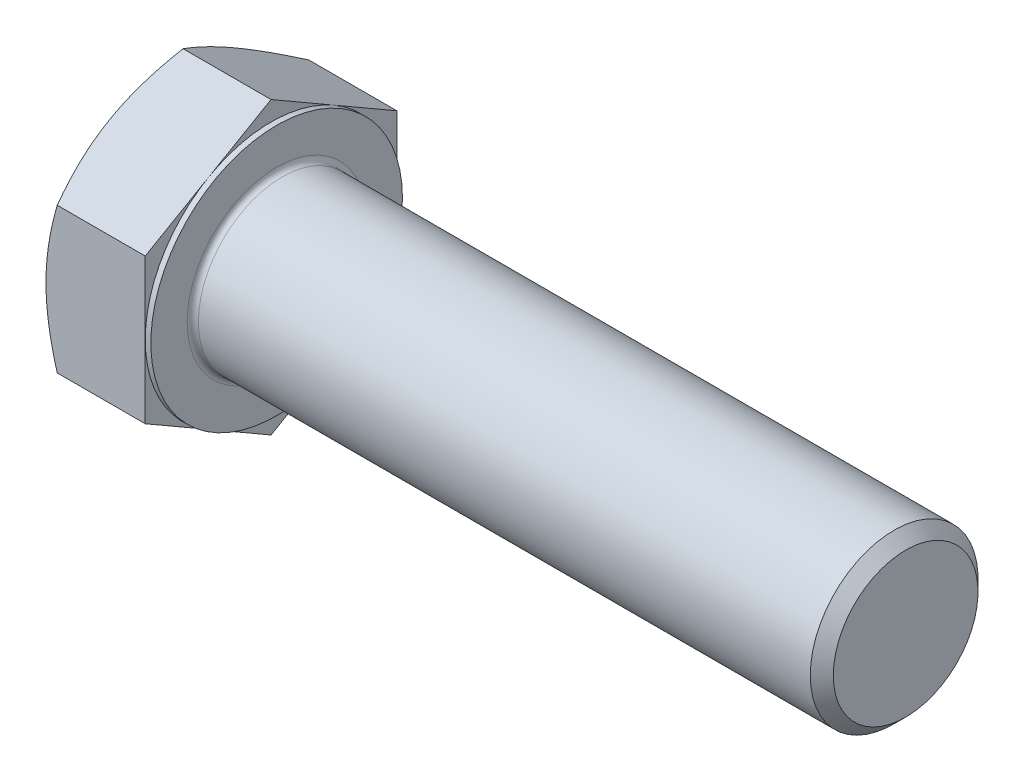
ISO-10303-21;
HEADER;
FILE_DESCRIPTION(('STEP AP214'),'2;1');
FILE_NAME('part.step','',(''),(''),'','','');
FILE_SCHEMA(('AUTOMOTIVE_DESIGN { 1 0 10303 214 1 1 1 1 }'));
ENDSEC;
DATA;
#1=APPLICATION_CONTEXT('core data for automotive mechanical design processes');
#2=APPLICATION_PROTOCOL_DEFINITION('international standard','automotive_design',2000,#1);
#3=PRODUCT_CONTEXT('',#1,'mechanical');
#4=PRODUCT('Part','Part','',(#3));
#5=PRODUCT_RELATED_PRODUCT_CATEGORY('part','',(#4));
#6=PRODUCT_DEFINITION_FORMATION('','',#4);
#7=PRODUCT_DEFINITION_CONTEXT('part definition',#1,'design');
#8=PRODUCT_DEFINITION('design','',#6,#7);
#9=PRODUCT_DEFINITION_SHAPE('','',#8);
#10=(LENGTH_UNIT() NAMED_UNIT(*) SI_UNIT(.MILLI.,.METRE.));
#11=(NAMED_UNIT(*) PLANE_ANGLE_UNIT() SI_UNIT($,.RADIAN.));
#12=(NAMED_UNIT(*) SI_UNIT($,.STERADIAN.) SOLID_ANGLE_UNIT());
#13=UNCERTAINTY_MEASURE_WITH_UNIT(LENGTH_MEASURE(1.E-05),#10,'distance_accuracy_value','');
#14=(GEOMETRIC_REPRESENTATION_CONTEXT(3) GLOBAL_UNCERTAINTY_ASSIGNED_CONTEXT((#13)) GLOBAL_UNIT_ASSIGNED_CONTEXT((#10,
#11,#12)) REPRESENTATION_CONTEXT('',''));
#15=CARTESIAN_POINT('',(0.,0.,0.));
#16=DIRECTION('',(0.,0.,1.));
#17=DIRECTION('',(1.,0.,0.));
#18=AXIS2_PLACEMENT_3D('',#15,#16,#17);
#19=CARTESIAN_POINT('',(15.,20.7846096908265,0.));
#20=DIRECTION('',(1.,0.,0.));
#21=DIRECTION('',(0.,0.,-1.));
#22=AXIS2_PLACEMENT_3D('',#19,#20,#21);
#23=PLANE('',#22);
#24=CARTESIAN_POINT('',(15.,0.,0.));
#25=DIRECTION('',(1.,0.,0.));
#26=DIRECTION('',(0.,0.,-1.));
#27=AXIS2_PLACEMENT_3D('',#24,#25,#26);
#28=CIRCLE('',#27,12.8);
#29=CARTESIAN_POINT('',(15.,0.,-12.8));
#30=VERTEX_POINT('',#29);
#31=EDGE_CURVE('E42',#30,#30,#28,.F.);
#32=ORIENTED_EDGE('',*,*,#31,.T.);
#33=EDGE_LOOP('',(#32));
#34=FACE_BOUND('',#33,.T.);
#35=CARTESIAN_POINT('',(15.,0.,0.));
#36=DIRECTION('',(1.,0.,0.));
#37=DIRECTION('',(0.,0.,-1.));
#38=AXIS2_PLACEMENT_3D('',#35,#36,#37);
#39=CIRCLE('',#38,18.);
#40=CARTESIAN_POINT('',(15.,0.,-18.));
#41=VERTEX_POINT('',#40);
#42=EDGE_CURVE('E299',#41,#41,#39,.T.);
#43=ORIENTED_EDGE('',*,*,#42,.T.);
#44=EDGE_LOOP('',(#43));
#45=FACE_BOUND('',#44,.T.);
#46=ADVANCED_FACE('F34',(#34,#45),#23,.T.);
#47=CARTESIAN_POINT('',(0.,0.,0.));
#48=DIRECTION('',(-1.,0.,0.));
#49=DIRECTION('',(0.,0.,1.));
#50=AXIS2_PLACEMENT_3D('',#47,#48,#49);
#51=CYLINDRICAL_SURFACE('',#50,12.);
#52=CARTESIAN_POINT('',(15.8,0.,0.));
#53=DIRECTION('',(1.,0.,0.));
#54=DIRECTION('',(0.,0.,-1.));
#55=AXIS2_PLACEMENT_3D('',#52,#53,#54);
#56=CIRCLE('',#55,12.);
#57=CARTESIAN_POINT('',(15.8,0.,-12.));
#58=VERTEX_POINT('',#57);
#59=EDGE_CURVE('E11',#58,#58,#56,.T.);
#60=ORIENTED_EDGE('',*,*,#59,.T.);
#61=EDGE_LOOP('',(#60));
#62=FACE_BOUND('',#61,.T.);
#63=CARTESIAN_POINT('',(103.352,0.,0.));
#64=DIRECTION('',(-1.,0.,0.));
#65=DIRECTION('',(0.,0.,1.));
#66=AXIS2_PLACEMENT_3D('',#63,#64,#65);
#67=CIRCLE('',#66,12.);
#68=CARTESIAN_POINT('',(103.352,0.,12.));
#69=VERTEX_POINT('',#68);
#70=EDGE_CURVE('E278',#69,#69,#67,.T.);
#71=ORIENTED_EDGE('',*,*,#70,.T.);
#72=EDGE_LOOP('',(#71));
#73=FACE_BOUND('',#72,.T.);
#74=ADVANCED_FACE('F252',(#62,#73),#51,.T.);
#75=CARTESIAN_POINT('',(105.,0.,0.));
#76=DIRECTION('',(-1.,0.,0.));
#77=DIRECTION('',(0.,0.,1.));
#78=AXIS2_PLACEMENT_3D('',#75,#76,#77);
#79=CONICAL_SURFACE('',#78,10.352,0.785398163397449);
#80=ORIENTED_EDGE('',*,*,#70,.F.);
#81=EDGE_LOOP('',(#80));
#82=FACE_BOUND('',#81,.T.);
#83=CARTESIAN_POINT('',(105.,0.,0.));
#84=DIRECTION('',(-1.,0.,0.));
#85=DIRECTION('',(0.,0.,1.));
#86=AXIS2_PLACEMENT_3D('',#83,#84,#85);
#87=CIRCLE('',#86,10.352);
#88=CARTESIAN_POINT('',(105.,0.,10.352));
#89=VERTEX_POINT('',#88);
#90=EDGE_CURVE('E276',#89,#89,#87,.T.);
#91=ORIENTED_EDGE('',*,*,#90,.T.);
#92=EDGE_LOOP('',(#91));
#93=FACE_BOUND('',#92,.T.);
#94=ADVANCED_FACE('F257',(#82,#93),#79,.T.);
#95=CARTESIAN_POINT('',(105.,0.,0.));
#96=DIRECTION('',(-1.,0.,0.));
#97=DIRECTION('',(0.,0.,1.));
#98=AXIS2_PLACEMENT_3D('',#95,#96,#97);
#99=PLANE('',#98);
#100=ORIENTED_EDGE('',*,*,#90,.F.);
#101=EDGE_LOOP('',(#100));
#102=FACE_BOUND('',#101,.T.);
#103=ADVANCED_FACE('F264',(#102),#99,.F.);
#104=CARTESIAN_POINT('',(14.2,18.,0.));
#105=DIRECTION('',(1.,0.,0.));
#106=DIRECTION('',(0.,0.,-1.));
#107=AXIS2_PLACEMENT_3D('',#104,#105,#106);
#108=PLANE('',#107);
#109=DIRECTION('',(0.,0.500000000000001,0.866025403784438));
#110=VECTOR('',#109,1.);
#111=CARTESIAN_POINT('',(14.2,10.3923048454132,-18.));
#112=LINE('',#111,#110);
#113=CARTESIAN_POINT('',(14.2,10.3923048454132,-18.));
#114=VERTEX_POINT('',#113);
#115=CARTESIAN_POINT('',(14.2,15.5884572681199,-9.00000000000002));
#116=VERTEX_POINT('',#115);
#117=EDGE_CURVE('E166',#114,#116,#112,.T.);
#118=ORIENTED_EDGE('',*,*,#117,.T.);
#119=CARTESIAN_POINT('',(14.2,0.,0.));
#120=DIRECTION('',(-1.,0.,0.));
#121=DIRECTION('',(0.,0.,1.));
#122=AXIS2_PLACEMENT_3D('',#119,#120,#121);
#123=CIRCLE('',#122,18.);
#124=CARTESIAN_POINT('',(14.2,0.,-18.));
#125=VERTEX_POINT('',#124);
#126=EDGE_CURVE('E49',#116,#125,#123,.T.);
#127=ORIENTED_EDGE('',*,*,#126,.T.);
#128=DIRECTION('',(0.,1.,0.));
#129=VECTOR('',#128,1.);
#130=CARTESIAN_POINT('',(14.2,10.3923048454132,-18.));
#131=LINE('',#130,#129);
#132=EDGE_CURVE('E302',#125,#114,#131,.T.);
#133=ORIENTED_EDGE('',*,*,#132,.T.);
#134=EDGE_LOOP('',(#118,#127,#133));
#135=FACE_BOUND('',#134,.T.);
#136=ADVANCED_FACE('F267',(#135),#108,.T.);
#137=CARTESIAN_POINT('',(14.2,20.7846096908265,0.));
#138=VERTEX_POINT('',#137);
#139=EDGE_CURVE('E164',#116,#138,#112,.T.);
#140=ORIENTED_EDGE('',*,*,#139,.T.);
#141=DIRECTION('',(0.,-0.500000000000001,0.866025403784438));
#142=VECTOR('',#141,1.);
#143=CARTESIAN_POINT('',(14.2,20.7846096908265,0.));
#144=LINE('',#143,#142);
#145=CARTESIAN_POINT('',(14.2,15.5884572681199,9.00000000000002));
#146=VERTEX_POINT('',#145);
#147=EDGE_CURVE('E163',#138,#146,#144,.T.);
#148=ORIENTED_EDGE('',*,*,#147,.T.);
#149=EDGE_CURVE('E152',#146,#116,#123,.T.);
#150=ORIENTED_EDGE('',*,*,#149,.T.);
#151=EDGE_LOOP('',(#140,#148,#150));
#152=FACE_BOUND('',#151,.T.);
#153=ADVANCED_FACE('F272',(#152),#108,.T.);
#154=CARTESIAN_POINT('',(14.2,10.3923048454133,18.));
#155=VERTEX_POINT('',#154);
#156=EDGE_CURVE('E131',#146,#155,#144,.T.);
#157=ORIENTED_EDGE('',*,*,#156,.T.);
#158=DIRECTION('',(0.,-1.,0.));
#159=VECTOR('',#158,1.);
#160=CARTESIAN_POINT('',(14.2,10.3923048454133,18.));
#161=LINE('',#160,#159);
#162=CARTESIAN_POINT('',(14.2,0.,18.));
#163=VERTEX_POINT('',#162);
#164=EDGE_CURVE('E125',#155,#163,#161,.T.);
#165=ORIENTED_EDGE('',*,*,#164,.T.);
#166=EDGE_CURVE('E129',#163,#146,#123,.T.);
#167=ORIENTED_EDGE('',*,*,#166,.T.);
#168=EDGE_LOOP('',(#157,#165,#167));
#169=FACE_BOUND('',#168,.T.);
#170=ADVANCED_FACE('F127',(#169),#108,.T.);
#171=CARTESIAN_POINT('',(14.2,-10.3923048454132,18.));
#172=VERTEX_POINT('',#171);
#173=EDGE_CURVE('E135',#163,#172,#161,.T.);
#174=ORIENTED_EDGE('',*,*,#173,.T.);
#175=DIRECTION('',(0.,-0.500000000000002,-0.866025403784438));
#176=VECTOR('',#175,1.);
#177=CARTESIAN_POINT('',(14.2,-20.7846096908265,0.));
#178=LINE('',#177,#176);
#179=CARTESIAN_POINT('',(14.2,-15.5884572681199,9.00000000000004));
#180=VERTEX_POINT('',#179);
#181=EDGE_CURVE('E142',#172,#180,#178,.T.);
#182=ORIENTED_EDGE('',*,*,#181,.T.);
#183=EDGE_CURVE('E139',#180,#163,#123,.T.);
#184=ORIENTED_EDGE('',*,*,#183,.T.);
#185=EDGE_LOOP('',(#174,#182,#184));
#186=FACE_BOUND('',#185,.T.);
#187=ADVANCED_FACE('F140',(#186),#108,.T.);
#188=CARTESIAN_POINT('',(14.2,-20.7846096908265,0.));
#189=VERTEX_POINT('',#188);
#190=EDGE_CURVE('E158',#180,#189,#178,.T.);
#191=ORIENTED_EDGE('',*,*,#190,.T.);
#192=DIRECTION('',(0.,0.5,-0.866025403784439));
#193=VECTOR('',#192,1.);
#194=CARTESIAN_POINT('',(14.2,-10.3923048454133,-18.));
#195=LINE('',#194,#193);
#196=CARTESIAN_POINT('',(14.2,-15.5884572681199,-9.));
#197=VERTEX_POINT('',#196);
#198=EDGE_CURVE('E340',#189,#197,#195,.T.);
#199=ORIENTED_EDGE('',*,*,#198,.T.);
#200=EDGE_CURVE('E146',#197,#180,#123,.T.);
#201=ORIENTED_EDGE('',*,*,#200,.T.);
#202=EDGE_LOOP('',(#191,#199,#201));
#203=FACE_BOUND('',#202,.T.);
#204=ADVANCED_FACE('F341',(#203),#108,.T.);
#205=CARTESIAN_POINT('',(14.2,-10.3923048454133,-18.));
#206=VERTEX_POINT('',#205);
#207=EDGE_CURVE('E153',#197,#206,#195,.T.);
#208=ORIENTED_EDGE('',*,*,#207,.T.);
#209=EDGE_CURVE('E303',#206,#125,#131,.T.);
#210=ORIENTED_EDGE('',*,*,#209,.T.);
#211=EDGE_CURVE('E310',#125,#197,#123,.T.);
#212=ORIENTED_EDGE('',*,*,#211,.T.);
#213=EDGE_LOOP('',(#208,#210,#212));
#214=FACE_BOUND('',#213,.T.);
#215=ADVANCED_FACE('F273',(#214),#108,.T.);
#216=CARTESIAN_POINT('',(0.,0.,0.));
#217=DIRECTION('',(-1.,0.,0.));
#218=DIRECTION('',(0.,0.,1.));
#219=AXIS2_PLACEMENT_3D('',#216,#217,#218);
#220=CYLINDRICAL_SURFACE('',#219,18.);
#221=ORIENTED_EDGE('',*,*,#126,.F.);
#222=ORIENTED_EDGE('',*,*,#149,.F.);
#223=ORIENTED_EDGE('',*,*,#166,.F.);
#224=ORIENTED_EDGE('',*,*,#183,.F.);
#225=ORIENTED_EDGE('',*,*,#200,.F.);
#226=ORIENTED_EDGE('',*,*,#211,.F.);
#227=EDGE_LOOP('',(#221,#222,#223,#224,#225,#226));
#228=FACE_BOUND('',#227,.T.);
#229=ORIENTED_EDGE('',*,*,#42,.F.);
#230=EDGE_LOOP('',(#229));
#231=FACE_BOUND('',#230,.T.);
#232=ADVANCED_FACE('F149',(#228,#231),#220,.T.);
#233=CARTESIAN_POINT('',(0.,20.7846096908265,0.));
#234=DIRECTION('',(1.,0.,0.));
#235=DIRECTION('',(0.,0.,-1.));
#236=AXIS2_PLACEMENT_3D('',#233,#234,#235);
#237=PLANE('',#236);
#238=CARTESIAN_POINT('',(0.,0.,0.));
#239=DIRECTION('',(1.,0.,0.));
#240=DIRECTION('',(0.,0.,-1.));
#241=AXIS2_PLACEMENT_3D('',#238,#239,#240);
#242=CIRCLE('',#241,18.);
#243=CARTESIAN_POINT('',(0.,0.,-18.));
#244=VERTEX_POINT('',#243);
#245=CARTESIAN_POINT('',(0.,15.5884572681199,-9.00000000000002));
#246=VERTEX_POINT('',#245);
#247=EDGE_CURVE('E298',#244,#246,#242,.T.);
#248=ORIENTED_EDGE('',*,*,#247,.F.);
#249=CARTESIAN_POINT('',(0.,-15.5884572681199,-9.));
#250=VERTEX_POINT('',#249);
#251=EDGE_CURVE('E294',#250,#244,#242,.T.);
#252=ORIENTED_EDGE('',*,*,#251,.F.);
#253=CARTESIAN_POINT('',(0.,-15.5884572681199,9.00000000000004));
#254=VERTEX_POINT('',#253);
#255=EDGE_CURVE('E297',#254,#250,#242,.T.);
#256=ORIENTED_EDGE('',*,*,#255,.F.);
#257=CARTESIAN_POINT('',(0.,0.,18.));
#258=VERTEX_POINT('',#257);
#259=EDGE_CURVE('E333',#258,#254,#242,.T.);
#260=ORIENTED_EDGE('',*,*,#259,.F.);
#261=CARTESIAN_POINT('',(0.,0.,0.));
#262=DIRECTION('',(-1.,0.,0.));
#263=DIRECTION('',(0.,0.,1.));
#264=AXIS2_PLACEMENT_3D('',#261,#262,#263);
#265=CIRCLE('',#264,18.);
#266=CARTESIAN_POINT('',(0.,15.5884572681199,9.00000000000002));
#267=VERTEX_POINT('',#266);
#268=EDGE_CURVE('E167',#258,#267,#265,.T.);
#269=ORIENTED_EDGE('',*,*,#268,.T.);
#270=EDGE_CURVE('E356',#246,#267,#242,.T.);
#271=ORIENTED_EDGE('',*,*,#270,.F.);
#272=EDGE_LOOP('',(#248,#252,#256,#260,#269,#271));
#273=FACE_BOUND('',#272,.T.);
#274=ADVANCED_FACE('F198',(#273),#237,.F.);
#275=CARTESIAN_POINT('',(0.,0.,0.));
#276=DIRECTION('',(1.,0.,0.));
#277=DIRECTION('',(0.,0.,-1.));
#278=AXIS2_PLACEMENT_3D('',#275,#276,#277);
#279=CONICAL_SURFACE('',#278,18.,1.0471975511966);
#280=CARTESIAN_POINT('',(1.60776182180894,10.3921893753594,18.0002));
#281=CARTESIAN_POINT('',(1.47589336556312,10.6206079566545,17.6045674118041));
#282=CARTESIAN_POINT('',(1.35000889021179,10.8499174930169,17.2073916441644));
#283=CARTESIAN_POINT('',(1.11187123611098,11.310375356009,16.4098552307175));
#284=CARTESIAN_POINT('',(0.999622540659326,11.5415242609305,16.0094935832795));
#285=CARTESIAN_POINT('',(0.790265297583962,12.0061075993295,15.2048116368225));
#286=CARTESIAN_POINT('',(0.693192573141009,12.2395460983593,14.8004842960602));
#287=CARTESIAN_POINT('',(0.51627174378766,12.7080451523823,13.9890201311945));
#288=CARTESIAN_POINT('',(0.436422652420739,12.9431056136839,13.5818834693696));
#289=CARTESIAN_POINT('',(0.297345302854857,13.4088255484441,12.7752328802672));
#290=CARTESIAN_POINT('',(0.237656723113625,13.6394504469968,12.3757788384836));
#291=CARTESIAN_POINT('',(0.137572375669447,14.1017570002651,11.5750403995507));
#292=CARTESIAN_POINT('',(0.0971769793251351,14.3334386752352,11.1737559673198));
#293=CARTESIAN_POINT('',(0.0366989588175636,14.7971912077607,10.3705130188471));
#294=CARTESIAN_POINT('',(0.0165921970388509,15.0292612730516,9.96855587484738));
#295=CARTESIAN_POINT('',(-0.0028761460025901,15.4936156120144,9.16427056704863));
#296=CARTESIAN_POINT('',(-0.00223836829112426,15.7258998788456,8.76194241509822));
#297=CARTESIAN_POINT('',(0.0183335794963803,16.1601606713826,8.00978065868889));
#298=CARTESIAN_POINT('',(0.0357591844006476,16.3621681381522,7.65989346273577));
#299=CARTESIAN_POINT('',(0.0859690685012189,16.765701206145,6.96095368643809));
#300=CARTESIAN_POINT('',(0.118753127736271,16.9672268142278,6.61190109421242));
#301=CARTESIAN_POINT('',(0.199111057578684,17.3697198122039,5.91476277202716));
#302=CARTESIAN_POINT('',(0.246698302564829,17.5706865308241,5.56667820474646));
#303=CARTESIAN_POINT('',(0.355822876567441,17.9716632799777,4.87216610255867));
#304=CARTESIAN_POINT('',(0.417360146472634,18.1716733145612,4.52573856063651));
#305=CARTESIAN_POINT('',(0.624462075708563,18.7788295665707,3.47411308402299));
#306=CARTESIAN_POINT('',(0.790677467933145,19.1842175215698,2.77196054918801));
#307=CARTESIAN_POINT('',(1.1679181702988,19.9889486858692,1.37812528618742));
#308=CARTESIAN_POINT('',(1.3788548871277,20.3883021980098,0.686424712978885));
#309=CARTESIAN_POINT('',(1.60776182180895,20.7847251608804,-0.000200000000000834));
#310=B_SPLINE_CURVE_WITH_KNOTS('',3,(#280,#281,#282,#283,#284,#285,#286,#287,#288,#289,#290,
#291,#292,#293,#294,#295,#296,#297,#298,#299,#300,#301,#302,#303,#304,#305,#306,#307,#308,#309),
.UNSPECIFIED.,.F.,.F.,(4,2,2,2,2,2,2,2,2,2,2,2,2,2,4),(0.,1.42650335783822,2.85347447244913,
4.28376471280638,5.71397301377359,7.10888071673008,8.50381526803681,9.8970882864255,
11.2903182514068,12.5031974791544,13.7160593367768,14.9300201888636,16.1439758970578,
18.6253607678546,21.1018751738864),.UNSPECIFIED.);
#311=CARTESIAN_POINT('',(1.60769515458674,20.7846096908265,0.));
#312=VERTEX_POINT('',#311);
#313=EDGE_CURVE('E218',#267,#312,#310,.T.);
#314=ORIENTED_EDGE('',*,*,#313,.T.);
#315=CARTESIAN_POINT('',(1.60776182180895,20.7847251608804,0.0002));
#316=CARTESIAN_POINT('',(1.47589336556313,20.5563065795853,-0.395432588195888));
#317=CARTESIAN_POINT('',(1.3500088902118,20.3269970432229,-0.79260835583556));
#318=CARTESIAN_POINT('',(1.11187123611099,19.8665391802308,-1.59014476928247));
#319=CARTESIAN_POINT('',(0.999622540659336,19.6353902753093,-1.99050641672051));
#320=CARTESIAN_POINT('',(0.790265297583972,19.1708069369103,-2.79518836317755));
#321=CARTESIAN_POINT('',(0.69319257314102,18.9373684378805,-3.19951570393979));
#322=CARTESIAN_POINT('',(0.516271743787669,18.4688693838575,-4.01097986880547));
#323=CARTESIAN_POINT('',(0.436422652420745,18.2338089225559,-4.41811653063043));
#324=CARTESIAN_POINT('',(0.297345302854861,17.7680889877957,-5.22476711973284));
#325=CARTESIAN_POINT('',(0.237656723113629,17.537464089243,-5.62422116151642));
#326=CARTESIAN_POINT('',(0.13757237566945,17.0751575359747,-6.42495960044929));
#327=CARTESIAN_POINT('',(0.0971769793251371,16.8434758610046,-6.82624403268017));
#328=CARTESIAN_POINT('',(0.0366989588175645,16.3797233284791,-7.62948698115295));
#329=CARTESIAN_POINT('',(0.0165921970388517,16.1476532631882,-8.03144412515262));
#330=CARTESIAN_POINT('',(-0.00287614600259086,15.6832989242254,-8.83572943295137));
#331=CARTESIAN_POINT('',(-0.00223836829112647,15.4510146573942,-9.23805758490179));
#332=CARTESIAN_POINT('',(0.0183335794963785,15.0167538648572,-9.99021934131111));
#333=CARTESIAN_POINT('',(0.0357591844006471,14.8147463980876,-10.3401065372642));
#334=CARTESIAN_POINT('',(0.0859690685012178,14.4112133300948,-11.0390463135619));
#335=CARTESIAN_POINT('',(0.118753127736268,14.209687722012,-11.3880989057876));
#336=CARTESIAN_POINT('',(0.199111057578679,13.8071947240359,-12.0852372279728));
#337=CARTESIAN_POINT('',(0.246698302564824,13.6062280054156,-12.4333217952535));
#338=CARTESIAN_POINT('',(0.355822876567435,13.2052512562621,-13.1278338974413));
#339=CARTESIAN_POINT('',(0.417360146472627,13.0052412216786,-13.4742614393635));
#340=CARTESIAN_POINT('',(0.624462075708554,12.3980849696691,-14.525886915977));
#341=CARTESIAN_POINT('',(0.790677467933135,11.99269701467,-15.228039450812));
#342=CARTESIAN_POINT('',(1.16791817029879,11.1879658503706,-16.6218747138126));
#343=CARTESIAN_POINT('',(1.37885488712769,10.78861233823,-17.3135752870211));
#344=CARTESIAN_POINT('',(1.60776182180894,10.3921893753594,-18.0002));
#345=B_SPLINE_CURVE_WITH_KNOTS('',3,(#315,#316,#317,#318,#319,#320,#321,#322,#323,#324,#325,
#326,#327,#328,#329,#330,#331,#332,#333,#334,#335,#336,#337,#338,#339,#340,#341,#342,#343,#344),
.UNSPECIFIED.,.F.,.F.,(4,2,2,2,2,2,2,2,2,2,2,2,2,2,4),(0.,1.42650335783821,2.85347447244913,
4.28376471280638,5.71397301377359,7.10888071673009,8.50381526803681,9.89708828642551,
11.2903182514068,12.5031974791545,13.7160593367768,14.9300201888636,16.1439758970578,
18.6253607678546,21.1018751738864),.UNSPECIFIED.);
#346=EDGE_CURVE('E57',#312,#246,#345,.T.);
#347=ORIENTED_EDGE('',*,*,#346,.T.);
#348=ORIENTED_EDGE('',*,*,#270,.T.);
#349=EDGE_LOOP('',(#314,#347,#348));
#350=FACE_BOUND('',#349,.T.);
#351=ADVANCED_FACE('F357',(#350),#279,.T.);
#352=CARTESIAN_POINT('',(8.808427130496,-27.9643402431046,18.));
#353=CARTESIAN_POINT('',(8.61750677802229,-27.5710662073959,18.));
#354=CARTESIAN_POINT('',(8.42753472732278,-27.1773320233033,18.));
#355=CARTESIAN_POINT('',(8.04970189891834,-26.3888473520457,18.));
#356=CARTESIAN_POINT('',(7.86184114230335,-25.9940968547769,18.));
#357=CARTESIAN_POINT('',(7.30169863346519,-24.8080724634241,18.));
#358=CARTESIAN_POINT('',(6.93291289399547,-24.0151412252697,18.));
#359=CARTESIAN_POINT('',(6.20490967153256,-22.4196974027513,18.));
#360=CARTESIAN_POINT('',(5.84575478283093,-21.6171561882138,18.));
#361=CARTESIAN_POINT('',(5.14207064659814,-20.0057089274192,18.));
#362=CARTESIAN_POINT('',(4.79754071148437,-19.1968031825104,18.));
#363=CARTESIAN_POINT('',(4.11611022257428,-17.5450041866493,18.));
#364=CARTESIAN_POINT('',(3.77981809482908,-16.7018586270337,18.));
#365=CARTESIAN_POINT('',(3.13256514784992,-15.0057154320914,18.));
#366=CARTESIAN_POINT('',(2.82160716489197,-14.1527167058291,18.));
#367=CARTESIAN_POINT('',(2.23315455016408,-12.43711867356,18.));
#368=CARTESIAN_POINT('',(1.95559259436132,-11.5745426460692,18.));
#369=CARTESIAN_POINT('',(1.44279031196762,-9.83693542713534,18.));
#370=CARTESIAN_POINT('',(1.20753670684013,-8.96190823687535,18.));
#371=CARTESIAN_POINT('',(0.895522308058551,-7.64230427801033,18.));
#372=CARTESIAN_POINT('',(0.798539960307996,-7.20248011867895,18.));
#373=CARTESIAN_POINT('',(0.619346663979908,-6.31981731439131,18.));
#374=CARTESIAN_POINT('',(0.537135413912321,-5.87697873115342,18.));
#375=CARTESIAN_POINT('',(0.388933808123912,-4.98859702789482,18.));
#376=CARTESIAN_POINT('',(0.322942911246029,-4.54305399861045,18.));
#377=CARTESIAN_POINT('',(0.208492383577689,-3.64970631100975,18.));
#378=CARTESIAN_POINT('',(0.160032741349877,-3.20190165416909,18.));
#379=CARTESIAN_POINT('',(0.0822220075298186,-2.3105496294157,18.));
#380=CARTESIAN_POINT('',(0.0526283717185129,-1.86702356479736,18.));
#381=CARTESIAN_POINT('',(0.0122265392151991,-0.979118128922017,18.));
#382=CARTESIAN_POINT('',(0.001418029635936,-0.534738772000976,18.));
#383=CARTESIAN_POINT('',(-0.00115631762080867,0.354079706847749,18.));
#384=CARTESIAN_POINT('',(0.00707792061225491,0.798518829006614,18.));
#385=CARTESIAN_POINT('',(0.0423876675323175,1.68665283494852,18.));
#386=CARTESIAN_POINT('',(0.0694640211301649,2.13034768446277,18.));
#387=CARTESIAN_POINT('',(0.156482092926351,3.19520589070312,18.));
#388=CARTESIAN_POINT('',(0.225281528377599,3.81565824171455,18.));
#389=CARTESIAN_POINT('',(0.395990058380338,5.05199420564998,18.));
#390=CARTESIAN_POINT('',(0.497903614582589,5.66787719147405,18.));
#391=CARTESIAN_POINT('',(0.731215030304265,6.89447554273952,18.));
#392=CARTESIAN_POINT('',(0.862635769426437,7.50518651446561,18.));
#393=CARTESIAN_POINT('',(1.15094813703739,8.72049972355144,18.));
#394=CARTESIAN_POINT('',(1.30783938943284,9.3251020509704,18.));
#395=CARTESIAN_POINT('',(1.64698004778297,10.5414936469055,18.));
#396=CARTESIAN_POINT('',(1.82971241990763,11.1531473228725,18.));
#397=CARTESIAN_POINT('',(2.21414736076855,12.3704299751548,18.));
#398=CARTESIAN_POINT('',(2.41585005430054,12.9760589118076,18.));
#399=CARTESIAN_POINT('',(2.83501520647243,14.1815895178699,18.));
#400=CARTESIAN_POINT('',(3.05247247513773,14.7814930003558,18.));
#401=CARTESIAN_POINT('',(3.50057968346486,15.9763233426994,18.));
#402=CARTESIAN_POINT('',(3.73122947137528,16.5712502597116,18.));
#403=CARTESIAN_POINT('',(4.28861115018066,17.9702204857275,18.));
#404=CARTESIAN_POINT('',(4.62002515649326,18.7723954680034,18.));
#405=CARTESIAN_POINT('',(5.29890820133677,20.3699430824083,18.));
#406=CARTESIAN_POINT('',(5.64637822330189,21.1653152943209,18.));
#407=CARTESIAN_POINT('',(6.35417286629492,22.7505167275409,18.));
#408=CARTESIAN_POINT('',(6.7145003341077,23.5403446743747,18.));
#409=CARTESIAN_POINT('',(7.44542750445922,25.1152008413773,18.));
#410=CARTESIAN_POINT('',(7.81602698916609,25.9002291628984,18.));
#411=CARTESIAN_POINT('',(8.56599428613879,27.4671332618931,18.));
#412=CARTESIAN_POINT('',(8.94537123353963,28.2490046594181,18.));
#413=CARTESIAN_POINT('',(9.71100797362349,29.8093695492503,18.));
#414=CARTESIAN_POINT('',(10.0972677957068,30.5878630271109,18.));
#415=CARTESIAN_POINT('',(10.8754456131813,32.1418914548454,18.));
#416=CARTESIAN_POINT('',(11.2673628909044,32.9174267644653,18.));
#417=CARTESIAN_POINT('',(12.0559785801665,34.4660583569055,18.));
#418=CARTESIAN_POINT('',(12.4526769828552,35.2391546442372,18.));
#419=CARTESIAN_POINT('',(13.5822142013125,37.4263866617491,18.));
#420=CARTESIAN_POINT('',(14.3197969559458,38.8380724746762,18.));
#421=CARTESIAN_POINT('',(15.8050655327946,41.6561700073893,18.));
#422=CARTESIAN_POINT('',(16.5527517104897,43.0625815393687,18.));
#423=CARTESIAN_POINT('',(18.0539928572742,45.8677641350797,18.));
#424=CARTESIAN_POINT('',(18.8075285851389,47.2665455031669,18.));
#425=CARTESIAN_POINT('',(19.942334530836,49.3622270652889,18.));
#426=CARTESIAN_POINT('',(20.3213432724281,50.0603536788783,18.));
#427=CARTESIAN_POINT('',(21.0807116459902,51.4558704710998,18.));
#428=CARTESIAN_POINT('',(21.4610712758458,52.1532606508822,18.));
#429=CARTESIAN_POINT('',(21.8420286714726,52.850324235841,18.));
#430=B_SPLINE_CURVE_WITH_KNOTS('',3,(#352,#353,#354,#355,#356,#357,#358,#359,#360,#361,#362,
#363,#364,#365,#366,#367,#368,#369,#370,#371,#372,#373,#374,#375,#376,#377,#378,#379,#380,#381,
#382,#383,#384,#385,#386,#387,#388,#389,#390,#391,#392,#393,#394,#395,#396,#397,#398,#399,#400,
#401,#402,#403,#404,#405,#406,#407,#408,#409,#410,#411,#412,#413,#414,#415,#416,#417,#418,#419,
#420,#421,#422,#423,#424,#425,#426,#427,#428,#429),.UNSPECIFIED.,.F.,.F.,(4,2,2,2,2,2,2,2,2,2,2,
2,2,2,2,2,2,2,2,2,2,2,2,2,2,2,2,2,2,2,2,2,2,2,2,2,2,2,4),(0.,1.31149885283058,2.62301079472824,
5.24642021614438,7.88402931842207,10.5215142775822,13.2444150325257,15.9676202112372,
18.6852401997085,21.402005765065,22.7529669019192,24.1039004614305,25.454788943841,
26.8056765449329,28.1388267463276,29.4719547424042,30.8050880527688,32.138281146834,
34.0100119547707,35.8819950561187,37.7554347199952,39.628846723491,41.5435776020438,
43.4583210774805,45.3724366289069,47.286530166998,49.890113594,52.4938567029427,
55.0981799317037,57.7024479744958,60.3095605480866,62.9166842606504,65.5234801070603,
68.1302711287376,72.908489911859,77.6868772522354,82.4533702914907,84.8364880602422,
87.2196021009335),.UNSPECIFIED.);
#431=CARTESIAN_POINT('',(1.60769515458672,10.3923048454133,18.));
#432=VERTEX_POINT('',#431);
#433=EDGE_CURVE('E232',#258,#432,#430,.T.);
#434=ORIENTED_EDGE('',*,*,#433,.T.);
#435=EDGE_CURVE('E231',#432,#267,#310,.T.);
#436=ORIENTED_EDGE('',*,*,#435,.T.);
#437=ORIENTED_EDGE('',*,*,#268,.F.);
#438=EDGE_LOOP('',(#434,#436,#437));
#439=FACE_BOUND('',#438,.T.);
#440=ADVANCED_FACE('F327',(#439),#279,.T.);
#441=CARTESIAN_POINT('',(1.60769515458671,-10.3923048454132,18.));
#442=VERTEX_POINT('',#441);
#443=EDGE_CURVE('E279',#442,#258,#430,.T.);
#444=ORIENTED_EDGE('',*,*,#443,.T.);
#445=ORIENTED_EDGE('',*,*,#259,.T.);
#446=CARTESIAN_POINT('',(1.60776182180895,-20.7847251608804,-0.000200000000000067));
#447=CARTESIAN_POINT('',(1.47589336556313,-20.5563065795853,0.395432588195889));
#448=CARTESIAN_POINT('',(1.3500088902118,-20.3269970432229,0.79260835583556));
#449=CARTESIAN_POINT('',(1.11187123611098,-19.8665391802308,1.59014476928247));
#450=CARTESIAN_POINT('',(0.999622540659331,-19.6353902753093,1.99050641672051));
#451=CARTESIAN_POINT('',(0.790265297583966,-19.1708069369103,2.79518836317754));
#452=CARTESIAN_POINT('',(0.693192573141013,-18.9373684378805,3.19951570393978));
#453=CARTESIAN_POINT('',(0.516271743787662,-18.4688693838575,4.01097986880547));
#454=CARTESIAN_POINT('',(0.43642265242074,-18.2338089225559,4.41811653063042));
#455=CARTESIAN_POINT('',(0.297345302854855,-17.7680889877957,5.22476711973284));
#456=CARTESIAN_POINT('',(0.237656723113622,-17.537464089243,5.62422116151642));
#457=CARTESIAN_POINT('',(0.137572375669442,-17.0751575359747,6.42495960044928));
#458=CARTESIAN_POINT('',(0.0971769793251299,-16.8434758610045,6.82624403268017));
#459=CARTESIAN_POINT('',(0.0366989588175576,-16.3797233284791,7.62948698115294));
#460=CARTESIAN_POINT('',(0.0165921970388444,-16.1476532631882,8.03144412515262));
#461=CARTESIAN_POINT('',(-0.00287614600259853,-15.6832989242253,8.83572943295137));
#462=CARTESIAN_POINT('',(-0.00223836829113415,-15.4510146573942,9.23805758490178));
#463=CARTESIAN_POINT('',(0.0183335794963693,-15.0167538648571,9.9902193413111));
#464=CARTESIAN_POINT('',(0.0357591844006367,-14.8147463980876,10.3401065372642));
#465=CARTESIAN_POINT('',(0.0859690685012067,-14.4112133300948,11.0390463135619));
#466=CARTESIAN_POINT('',(0.118753127736257,-14.209687722012,11.3880989057876));
#467=CARTESIAN_POINT('',(0.199111057578669,-13.8071947240359,12.0852372279728));
#468=CARTESIAN_POINT('',(0.246698302564814,-13.6062280054156,12.4333217952535));
#469=CARTESIAN_POINT('',(0.355822876567424,-13.2052512562621,13.1278338974413));
#470=CARTESIAN_POINT('',(0.417360146472615,-13.0052412216786,13.4742614393635));
#471=CARTESIAN_POINT('',(0.624462075708541,-12.3980849696691,14.525886915977));
#472=CARTESIAN_POINT('',(0.790677467933124,-11.99269701467,15.228039450812));
#473=CARTESIAN_POINT('',(1.16791817029878,-11.1879658503706,16.6218747138126));
#474=CARTESIAN_POINT('',(1.37885488712768,-10.78861233823,17.3135752870211));
#475=CARTESIAN_POINT('',(1.60776182180893,-10.3921893753594,18.0002));
#476=B_SPLINE_CURVE_WITH_KNOTS('',3,(#446,#447,#448,#449,#450,#451,#452,#453,#454,#455,#456,
#457,#458,#459,#460,#461,#462,#463,#464,#465,#466,#467,#468,#469,#470,#471,#472,#473,#474,#475),
.UNSPECIFIED.,.F.,.F.,(4,2,2,2,2,2,2,2,2,2,2,2,2,2,4),(0.,1.42650335783821,2.85347447244913,
4.28376471280638,5.71397301377359,7.10888071673008,8.50381526803681,9.89708828642551,
11.2903182514068,12.5031974791545,13.7160593367768,14.9300201888636,16.1439758970578,
18.6253607678546,21.1018751738865),.UNSPECIFIED.);
#477=EDGE_CURVE('E220',#254,#442,#476,.T.);
#478=ORIENTED_EDGE('',*,*,#477,.T.);
#479=EDGE_LOOP('',(#444,#445,#478));
#480=FACE_BOUND('',#479,.T.);
#481=ADVANCED_FACE('F187',(#480),#279,.T.);
#482=CARTESIAN_POINT('',(1.60769515458673,-20.7846096908265,0.));
#483=VERTEX_POINT('',#482);
#484=EDGE_CURVE('E212',#483,#254,#476,.T.);
#485=ORIENTED_EDGE('',*,*,#484,.T.);
#486=ORIENTED_EDGE('',*,*,#255,.T.);
#487=CARTESIAN_POINT('',(1.60776182180895,-10.3921893753594,-18.0002));
#488=CARTESIAN_POINT('',(1.47589336556313,-10.6206079566545,-17.6045674118041));
#489=CARTESIAN_POINT('',(1.3500088902118,-10.8499174930169,-17.2073916441644));
#490=CARTESIAN_POINT('',(1.11187123611098,-11.310375356009,-16.4098552307175));
#491=CARTESIAN_POINT('',(0.999622540659334,-11.5415242609305,-16.0094935832795));
#492=CARTESIAN_POINT('',(0.79026529758397,-12.0061075993295,-15.2048116368225));
#493=CARTESIAN_POINT('',(0.693192573141017,-12.2395460983593,-14.8004842960602));
#494=CARTESIAN_POINT('',(0.516271743787666,-12.7080451523823,-13.9890201311945));
#495=CARTESIAN_POINT('',(0.436422652420745,-12.9431056136839,-13.5818834693696));
#496=CARTESIAN_POINT('',(0.297345302854861,-13.4088255484441,-12.7752328802672));
#497=CARTESIAN_POINT('',(0.237656723113629,-13.6394504469968,-12.3757788384836));
#498=CARTESIAN_POINT('',(0.137572375669451,-14.1017570002651,-11.5750403995507));
#499=CARTESIAN_POINT('',(0.0971769793251397,-14.3334386752353,-11.1737559673198));
#500=CARTESIAN_POINT('',(0.036698958817569,-14.7971912077607,-10.370513018847));
#501=CARTESIAN_POINT('',(0.0165921970388565,-15.0292612730516,-9.96855587484736));
#502=CARTESIAN_POINT('',(-0.00287614600258469,-15.4936156120145,-9.16427056704861));
#503=CARTESIAN_POINT('',(-0.00223836829111938,-15.7258998788456,-8.7619424150982));
#504=CARTESIAN_POINT('',(0.0183335794963854,-16.1601606713827,-8.00978065868888));
#505=CARTESIAN_POINT('',(0.0357591844006532,-16.3621681381522,-7.65989346273576));
#506=CARTESIAN_POINT('',(0.0859690685012242,-16.765701206145,-6.96095368643808));
#507=CARTESIAN_POINT('',(0.118753127736276,-16.9672268142278,-6.61190109421241));
#508=CARTESIAN_POINT('',(0.199111057578688,-17.3697198122039,-5.91476277202715));
#509=CARTESIAN_POINT('',(0.246698302564833,-17.5706865308241,-5.56667820474646));
#510=CARTESIAN_POINT('',(0.355822876567444,-17.9716632799777,-4.87216610255866));
#511=CARTESIAN_POINT('',(0.417360146472636,-18.1716733145612,-4.5257385606365));
#512=CARTESIAN_POINT('',(0.624462075708563,-18.7788295665707,-3.47411308402298));
#513=CARTESIAN_POINT('',(0.790677467933146,-19.1842175215698,-2.77196054918801));
#514=CARTESIAN_POINT('',(1.1679181702988,-19.9889486858692,-1.37812528618742));
#515=CARTESIAN_POINT('',(1.3788548871277,-20.3883021980098,-0.686424712978881));
#516=CARTESIAN_POINT('',(1.60776182180895,-20.7847251608804,0.000200000000000457));
#517=B_SPLINE_CURVE_WITH_KNOTS('',3,(#487,#488,#489,#490,#491,#492,#493,#494,#495,#496,#497,
#498,#499,#500,#501,#502,#503,#504,#505,#506,#507,#508,#509,#510,#511,#512,#513,#514,#515,#516),
.UNSPECIFIED.,.F.,.F.,(4,2,2,2,2,2,2,2,2,2,2,2,2,2,4),(0.,1.42650335783821,2.85347447244913,
4.28376471280638,5.71397301377359,7.10888071673009,8.50381526803681,9.89708828642551,
11.2903182514068,12.5031974791544,13.7160593367768,14.9300201888636,16.1439758970578,
18.6253607678546,21.1018751738864),.UNSPECIFIED.);
#518=EDGE_CURVE('E219',#250,#483,#517,.T.);
#519=ORIENTED_EDGE('',*,*,#518,.T.);
#520=EDGE_LOOP('',(#485,#486,#519));
#521=FACE_BOUND('',#520,.T.);
#522=ADVANCED_FACE('F355',(#521),#279,.T.);
#523=CARTESIAN_POINT('',(1.60769515458672,10.3923048454132,-18.));
#524=VERTEX_POINT('',#523);
#525=EDGE_CURVE('E221',#246,#524,#345,.T.);
#526=ORIENTED_EDGE('',*,*,#525,.T.);
#527=CARTESIAN_POINT('',(8.80842713049604,-27.9643402431047,-18.));
#528=CARTESIAN_POINT('',(8.61750677802233,-27.5710662073959,-18.));
#529=CARTESIAN_POINT('',(8.42753472732281,-27.1773320233034,-18.));
#530=CARTESIAN_POINT('',(8.04970189891838,-26.3888473520458,-18.));
#531=CARTESIAN_POINT('',(7.86184114230339,-25.994096854777,-18.));
#532=CARTESIAN_POINT('',(7.30169863346522,-24.8080724634242,-18.));
#533=CARTESIAN_POINT('',(6.9329128939955,-24.0151412252698,-18.));
#534=CARTESIAN_POINT('',(6.20490967153258,-22.4196974027513,-18.));
#535=CARTESIAN_POINT('',(5.84575478283096,-21.6171561882139,-18.));
#536=CARTESIAN_POINT('',(5.14207064659817,-20.0057089274192,-18.));
#537=CARTESIAN_POINT('',(4.79754071148439,-19.1968031825105,-18.));
#538=CARTESIAN_POINT('',(4.11611022257431,-17.5450041866494,-18.));
#539=CARTESIAN_POINT('',(3.7798180948291,-16.7018586270337,-18.));
#540=CARTESIAN_POINT('',(3.13256514784994,-15.0057154320914,-18.));
#541=CARTESIAN_POINT('',(2.82160716489199,-14.1527167058292,-18.));
#542=CARTESIAN_POINT('',(2.23315455016409,-12.4371186735601,-18.));
#543=CARTESIAN_POINT('',(1.95559259436134,-11.5745426460693,-18.));
#544=CARTESIAN_POINT('',(1.44279031196763,-9.83693542713539,-18.));
#545=CARTESIAN_POINT('',(1.20753670684015,-8.9619082368754,-18.));
#546=CARTESIAN_POINT('',(0.895522308058564,-7.64230427801037,-18.));
#547=CARTESIAN_POINT('',(0.79853996030801,-7.202480118679,-18.));
#548=CARTESIAN_POINT('',(0.619346663979921,-6.31981731439136,-18.));
#549=CARTESIAN_POINT('',(0.537135413912331,-5.87697873115347,-18.));
#550=CARTESIAN_POINT('',(0.38893380812392,-4.98859702789487,-18.));
#551=CARTESIAN_POINT('',(0.322942911246038,-4.5430539986105,-18.));
#552=CARTESIAN_POINT('',(0.208492383577696,-3.64970631100979,-18.));
#553=CARTESIAN_POINT('',(0.160032741349881,-3.20190165416913,-18.));
#554=CARTESIAN_POINT('',(0.0822220075298209,-2.31054962941575,-18.));
#555=CARTESIAN_POINT('',(0.0526283717185148,-1.8670235647974,-18.));
#556=CARTESIAN_POINT('',(0.0122265392151994,-0.979118128922058,-18.));
#557=CARTESIAN_POINT('',(0.00141802963593532,-0.534738772001016,-18.));
#558=CARTESIAN_POINT('',(-0.00115631762080998,0.354079706847712,-18.));
#559=CARTESIAN_POINT('',(0.00707792061225401,0.798518829006579,-18.));
#560=CARTESIAN_POINT('',(0.0423876675323161,1.68665283494848,-18.));
#561=CARTESIAN_POINT('',(0.0694640211301625,2.13034768446274,-18.));
#562=CARTESIAN_POINT('',(0.156482092926346,3.19520589070308,-18.));
#563=CARTESIAN_POINT('',(0.225281528377594,3.81565824171452,-18.));
#564=CARTESIAN_POINT('',(0.395990058380332,5.05199420564994,-18.));
#565=CARTESIAN_POINT('',(0.497903614582583,5.66787719147401,-18.));
#566=CARTESIAN_POINT('',(0.731215030304256,6.89447554273948,-18.));
#567=CARTESIAN_POINT('',(0.862635769426427,7.50518651446557,-18.));
#568=CARTESIAN_POINT('',(1.15094813703738,8.72049972355139,-18.));
#569=CARTESIAN_POINT('',(1.30783938943282,9.32510205097035,-18.));
#570=CARTESIAN_POINT('',(1.64698004778296,10.5414936469054,-18.));
#571=CARTESIAN_POINT('',(1.82971241990761,11.1531473228724,-18.));
#572=CARTESIAN_POINT('',(2.21414736076853,12.3704299751548,-18.));
#573=CARTESIAN_POINT('',(2.41585005430052,12.9760589118076,-18.));
#574=CARTESIAN_POINT('',(2.83501520647241,14.1815895178699,-18.));
#575=CARTESIAN_POINT('',(3.05247247513771,14.7814930003557,-18.));
#576=CARTESIAN_POINT('',(3.50057968346484,15.9763233426993,-18.));
#577=CARTESIAN_POINT('',(3.73122947137525,16.5712502597115,-18.));
#578=CARTESIAN_POINT('',(4.28861115018064,17.9702204857274,-18.));
#579=CARTESIAN_POINT('',(4.62002515649323,18.7723954680033,-18.));
#580=CARTESIAN_POINT('',(5.29890820133675,20.3699430824083,-18.));
#581=CARTESIAN_POINT('',(5.64637822330187,21.1653152943209,-18.));
#582=CARTESIAN_POINT('',(6.3541728662949,22.7505167275409,-18.));
#583=CARTESIAN_POINT('',(6.71450033410768,23.5403446743746,-18.));
#584=CARTESIAN_POINT('',(7.4454275044592,25.1152008413772,-18.));
#585=CARTESIAN_POINT('',(7.81602698916607,25.9002291628984,-18.));
#586=CARTESIAN_POINT('',(8.56599428613877,27.467133261893,-18.));
#587=CARTESIAN_POINT('',(8.94537123353962,28.2490046594181,-18.));
#588=CARTESIAN_POINT('',(9.71100797362348,29.8093695492503,-18.));
#589=CARTESIAN_POINT('',(10.0972677957067,30.5878630271109,-18.));
#590=CARTESIAN_POINT('',(10.8754456131813,32.1418914548454,-18.));
#591=CARTESIAN_POINT('',(11.2673628909044,32.9174267644653,-18.));
#592=CARTESIAN_POINT('',(12.0559785801665,34.4660583569055,-18.));
#593=CARTESIAN_POINT('',(12.4526769828552,35.2391546442372,-18.));
#594=CARTESIAN_POINT('',(13.5822142013125,37.4263866617491,-18.));
#595=CARTESIAN_POINT('',(14.3197969559458,38.8380724746762,-18.));
#596=CARTESIAN_POINT('',(15.8050655327946,41.6561700073893,-18.));
#597=CARTESIAN_POINT('',(16.5527517104897,43.0625815393687,-18.));
#598=CARTESIAN_POINT('',(18.0539928572742,45.8677641350797,-18.));
#599=CARTESIAN_POINT('',(18.8075285851389,47.2665455031669,-18.));
#600=CARTESIAN_POINT('',(19.942334530836,49.3622270652889,-18.));
#601=CARTESIAN_POINT('',(20.3213432724281,50.0603536788783,-18.));
#602=CARTESIAN_POINT('',(21.0807116459902,51.4558704710998,-18.));
#603=CARTESIAN_POINT('',(21.4610712758458,52.1532606508822,-18.));
#604=CARTESIAN_POINT('',(21.8420286714726,52.850324235841,-18.));
#605=B_SPLINE_CURVE_WITH_KNOTS('',3,(#527,#528,#529,#530,#531,#532,#533,#534,#535,#536,#537,
#538,#539,#540,#541,#542,#543,#544,#545,#546,#547,#548,#549,#550,#551,#552,#553,#554,#555,#556,
#557,#558,#559,#560,#561,#562,#563,#564,#565,#566,#567,#568,#569,#570,#571,#572,#573,#574,#575,
#576,#577,#578,#579,#580,#581,#582,#583,#584,#585,#586,#587,#588,#589,#590,#591,#592,#593,#594,
#595,#596,#597,#598,#599,#600,#601,#602,#603,#604),.UNSPECIFIED.,.F.,.F.,(4,2,2,2,2,2,2,2,2,2,2,
2,2,2,2,2,2,2,2,2,2,2,2,2,2,2,2,2,2,2,2,2,2,2,2,2,2,2,4),(0.,1.31149885283059,2.62301079472824,
5.24642021614438,7.88402931842208,10.5215142775822,13.2444150325258,15.9676202112372,
18.6852401997085,21.402005765065,22.7529669019192,24.1039004614305,25.454788943841,
26.805676544933,28.1388267463277,29.4719547424042,30.8050880527689,32.1382811468341,
34.0100119547707,35.8819950561187,37.7554347199952,39.628846723491,41.5435776020438,
43.4583210774805,45.3724366289069,47.286530166998,49.8901135940001,52.4938567029427,
55.0981799317037,57.7024479744959,60.3095605480867,62.9166842606505,65.5234801070604,
68.1302711287377,72.9084899118591,77.6868772522355,82.4533702914908,84.8364880602422,
87.2196021009336),.UNSPECIFIED.);
#606=EDGE_CURVE('E179',#524,#244,#605,.F.);
#607=ORIENTED_EDGE('',*,*,#606,.T.);
#608=ORIENTED_EDGE('',*,*,#247,.T.);
#609=EDGE_LOOP('',(#526,#607,#608));
#610=FACE_BOUND('',#609,.T.);
#611=ADVANCED_FACE('F352',(#610),#279,.T.);
#612=CARTESIAN_POINT('',(1.60769515458673,-10.3923048454133,-18.));
#613=VERTEX_POINT('',#612);
#614=EDGE_CURVE('E180',#613,#250,#517,.T.);
#615=ORIENTED_EDGE('',*,*,#614,.T.);
#616=ORIENTED_EDGE('',*,*,#251,.T.);
#617=EDGE_CURVE('E170',#244,#613,#605,.F.);
#618=ORIENTED_EDGE('',*,*,#617,.T.);
#619=EDGE_LOOP('',(#615,#616,#618));
#620=FACE_BOUND('',#619,.T.);
#621=ADVANCED_FACE('F196',(#620),#279,.T.);
#622=CARTESIAN_POINT('',(15.,10.3923048454132,-18.));
#623=DIRECTION('',(0.,0.,1.));
#624=DIRECTION('',(1.,0.,0.));
#625=AXIS2_PLACEMENT_3D('',#622,#623,#624);
#626=PLANE('',#625);
#627=ORIENTED_EDGE('',*,*,#209,.F.);
#628=DIRECTION('',(-1.,0.,0.));
#629=VECTOR('',#628,1.);
#630=CARTESIAN_POINT('',(15.,-10.3923048454133,-18.));
#631=LINE('',#630,#629);
#632=EDGE_CURVE('E285',#206,#613,#631,.T.);
#633=ORIENTED_EDGE('',*,*,#632,.T.);
#634=ORIENTED_EDGE('',*,*,#617,.F.);
#635=ORIENTED_EDGE('',*,*,#606,.F.);
#636=DIRECTION('',(-1.,0.,0.));
#637=VECTOR('',#636,1.);
#638=CARTESIAN_POINT('',(15.,10.3923048454132,-18.));
#639=LINE('',#638,#637);
#640=EDGE_CURVE('E281',#114,#524,#639,.T.);
#641=ORIENTED_EDGE('',*,*,#640,.F.);
#642=ORIENTED_EDGE('',*,*,#132,.F.);
#643=EDGE_LOOP('',(#627,#633,#634,#635,#641,#642));
#644=FACE_BOUND('',#643,.T.);
#645=ADVANCED_FACE('F191',(#644),#626,.F.);
#646=CARTESIAN_POINT('',(15.,-10.3923048454133,-18.));
#647=DIRECTION('',(0.,0.866025403784439,0.5));
#648=DIRECTION('',(0.,-0.5,0.866025403784439));
#649=AXIS2_PLACEMENT_3D('',#646,#647,#648);
#650=PLANE('',#649);
#651=ORIENTED_EDGE('',*,*,#198,.F.);
#652=DIRECTION('',(-1.,0.,0.));
#653=VECTOR('',#652,1.);
#654=CARTESIAN_POINT('',(15.,-20.7846096908265,0.));
#655=LINE('',#654,#653);
#656=EDGE_CURVE('E287',#189,#483,#655,.T.);
#657=ORIENTED_EDGE('',*,*,#656,.T.);
#658=ORIENTED_EDGE('',*,*,#518,.F.);
#659=ORIENTED_EDGE('',*,*,#614,.F.);
#660=ORIENTED_EDGE('',*,*,#632,.F.);
#661=ORIENTED_EDGE('',*,*,#207,.F.);
#662=EDGE_LOOP('',(#651,#657,#658,#659,#660,#661));
#663=FACE_BOUND('',#662,.T.);
#664=ADVANCED_FACE('F195',(#663),#650,.F.);
#665=CARTESIAN_POINT('',(15.,-20.7846096908265,0.));
#666=DIRECTION('',(0.,0.866025403784437,-0.500000000000002));
#667=DIRECTION('',(0.,0.500000000000002,0.866025403784438));
#668=AXIS2_PLACEMENT_3D('',#665,#666,#667);
#669=PLANE('',#668);
#670=ORIENTED_EDGE('',*,*,#181,.F.);
#671=DIRECTION('',(-1.,0.,0.));
#672=VECTOR('',#671,1.);
#673=CARTESIAN_POINT('',(15.,-10.3923048454132,18.));
#674=LINE('',#673,#672);
#675=EDGE_CURVE('E157',#172,#442,#674,.T.);
#676=ORIENTED_EDGE('',*,*,#675,.T.);
#677=ORIENTED_EDGE('',*,*,#477,.F.);
#678=ORIENTED_EDGE('',*,*,#484,.F.);
#679=ORIENTED_EDGE('',*,*,#656,.F.);
#680=ORIENTED_EDGE('',*,*,#190,.F.);
#681=EDGE_LOOP('',(#670,#676,#677,#678,#679,#680));
#682=FACE_BOUND('',#681,.T.);
#683=ADVANCED_FACE('F203',(#682),#669,.F.);
#684=CARTESIAN_POINT('',(15.,10.3923048454133,18.));
#685=DIRECTION('',(0.,0.,-1.));
#686=DIRECTION('',(0.,1.,0.));
#687=AXIS2_PLACEMENT_3D('',#684,#685,#686);
#688=PLANE('',#687);
#689=ORIENTED_EDGE('',*,*,#164,.F.);
#690=DIRECTION('',(-1.,0.,0.));
#691=VECTOR('',#690,1.);
#692=CARTESIAN_POINT('',(15.,10.3923048454133,18.));
#693=LINE('',#692,#691);
#694=EDGE_CURVE('E290',#155,#432,#693,.T.);
#695=ORIENTED_EDGE('',*,*,#694,.T.);
#696=ORIENTED_EDGE('',*,*,#433,.F.);
#697=ORIENTED_EDGE('',*,*,#443,.F.);
#698=ORIENTED_EDGE('',*,*,#675,.F.);
#699=ORIENTED_EDGE('',*,*,#173,.F.);
#700=EDGE_LOOP('',(#689,#695,#696,#697,#698,#699));
#701=FACE_BOUND('',#700,.T.);
#702=ADVANCED_FACE('F155',(#701),#688,.F.);
#703=CARTESIAN_POINT('',(15.,20.7846096908265,0.));
#704=DIRECTION('',(0.,-0.866025403784438,-0.500000000000001));
#705=DIRECTION('',(0.,0.500000000000001,-0.866025403784438));
#706=AXIS2_PLACEMENT_3D('',#703,#704,#705);
#707=PLANE('',#706);
#708=ORIENTED_EDGE('',*,*,#147,.F.);
#709=DIRECTION('',(-1.,0.,0.));
#710=VECTOR('',#709,1.);
#711=CARTESIAN_POINT('',(15.,20.7846096908265,0.));
#712=LINE('',#711,#710);
#713=EDGE_CURVE('E292',#138,#312,#712,.T.);
#714=ORIENTED_EDGE('',*,*,#713,.T.);
#715=ORIENTED_EDGE('',*,*,#313,.F.);
#716=ORIENTED_EDGE('',*,*,#435,.F.);
#717=ORIENTED_EDGE('',*,*,#694,.F.);
#718=ORIENTED_EDGE('',*,*,#156,.F.);
#719=EDGE_LOOP('',(#708,#714,#715,#716,#717,#718));
#720=FACE_BOUND('',#719,.T.);
#721=ADVANCED_FACE('F238',(#720),#707,.F.);
#722=CARTESIAN_POINT('',(15.,10.3923048454132,-18.));
#723=DIRECTION('',(0.,-0.866025403784438,0.500000000000001));
#724=DIRECTION('',(0.,-0.500000000000001,-0.866025403784438));
#725=AXIS2_PLACEMENT_3D('',#722,#723,#724);
#726=PLANE('',#725);
#727=ORIENTED_EDGE('',*,*,#117,.F.);
#728=ORIENTED_EDGE('',*,*,#640,.T.);
#729=ORIENTED_EDGE('',*,*,#525,.F.);
#730=ORIENTED_EDGE('',*,*,#346,.F.);
#731=ORIENTED_EDGE('',*,*,#713,.F.);
#732=ORIENTED_EDGE('',*,*,#139,.F.);
#733=EDGE_LOOP('',(#727,#728,#729,#730,#731,#732));
#734=FACE_BOUND('',#733,.T.);
#735=ADVANCED_FACE('F241',(#734),#726,.F.);
#736=CARTESIAN_POINT('',(15.8,0.,0.));
#737=DIRECTION('',(1.,0.,0.));
#738=DIRECTION('',(0.,0.,-1.));
#739=AXIS2_PLACEMENT_3D('',#736,#737,#738);
#740=TOROIDAL_SURFACE('',#739,12.8,0.8);
#741=ORIENTED_EDGE('',*,*,#59,.F.);
#742=EDGE_LOOP('',(#741));
#743=FACE_BOUND('',#742,.T.);
#744=ORIENTED_EDGE('',*,*,#31,.F.);
#745=EDGE_LOOP('',(#744));
#746=FACE_BOUND('',#745,.T.);
#747=ADVANCED_FACE('F36',(#743,#746),#740,.F.);
#748=CLOSED_SHELL('',(#46,#74,#94,#103,#136,#153,#170,#187,#204,#215,#232,#274,#351,#440,#481,
#522,#611,#621,#645,#664,#683,#702,#721,#735,#747));
#749=MANIFOLD_SOLID_BREP('B2',#748);
#750=ADVANCED_BREP_SHAPE_REPRESENTATION('',(#18,#749),#14);
#751=SHAPE_DEFINITION_REPRESENTATION(#9,#750);
ENDSEC;
END-ISO-10303-21;
